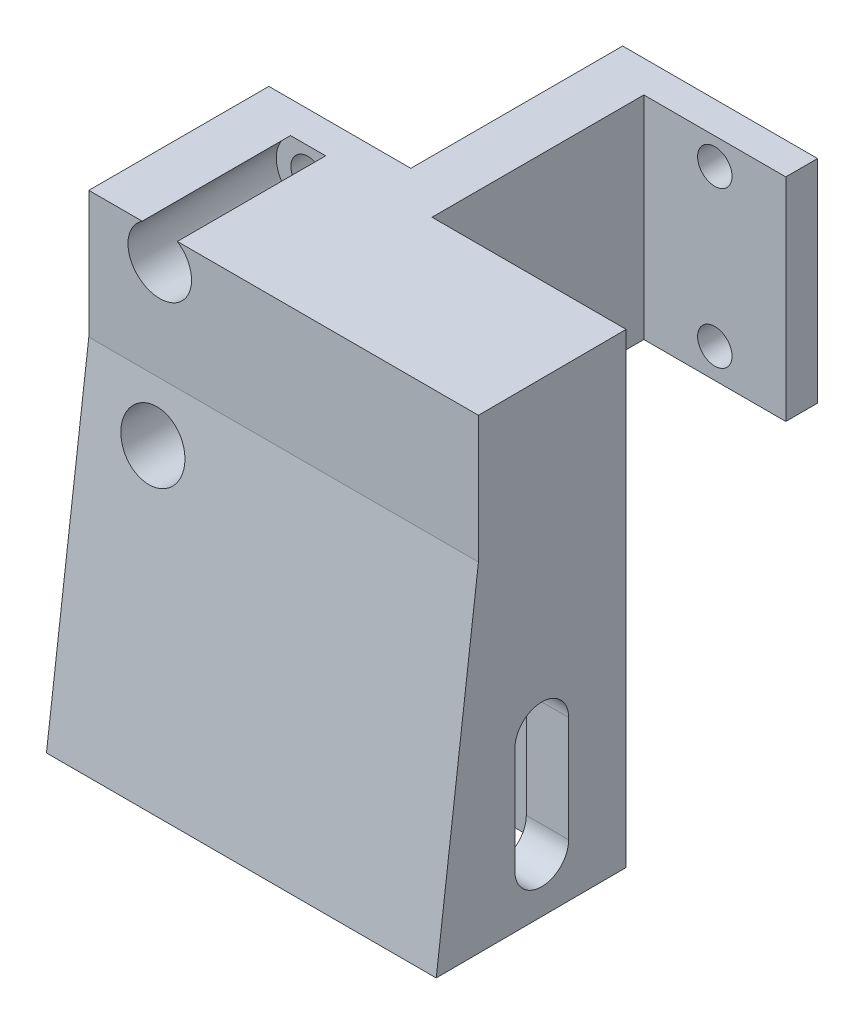
ISO-10303-21;
HEADER;
FILE_DESCRIPTION(('STEP AP214'),'2;1');
FILE_NAME('part.step','',(''),(''),'','','');
FILE_SCHEMA(('AUTOMOTIVE_DESIGN { 1 0 10303 214 1 1 1 1 }'));
ENDSEC;
DATA;
#1=APPLICATION_CONTEXT('core data for automotive mechanical design processes');
#2=APPLICATION_PROTOCOL_DEFINITION('international standard','automotive_design',2000,#1);
#3=PRODUCT_CONTEXT('',#1,'mechanical');
#4=PRODUCT('Part','Part','',(#3));
#5=PRODUCT_RELATED_PRODUCT_CATEGORY('part','',(#4));
#6=PRODUCT_DEFINITION_FORMATION('','',#4);
#7=PRODUCT_DEFINITION_CONTEXT('part definition',#1,'design');
#8=PRODUCT_DEFINITION('design','',#6,#7);
#9=PRODUCT_DEFINITION_SHAPE('','',#8);
#10=(LENGTH_UNIT() NAMED_UNIT(*) SI_UNIT(.MILLI.,.METRE.));
#11=(NAMED_UNIT(*) PLANE_ANGLE_UNIT() SI_UNIT($,.RADIAN.));
#12=(NAMED_UNIT(*) SI_UNIT($,.STERADIAN.) SOLID_ANGLE_UNIT());
#13=UNCERTAINTY_MEASURE_WITH_UNIT(LENGTH_MEASURE(1.E-05),#10,'distance_accuracy_value','');
#14=(GEOMETRIC_REPRESENTATION_CONTEXT(3) GLOBAL_UNCERTAINTY_ASSIGNED_CONTEXT((#13)) GLOBAL_UNIT_ASSIGNED_CONTEXT((#10,
#11,#12)) REPRESENTATION_CONTEXT('',''));
#15=CARTESIAN_POINT('',(0.,0.,0.));
#16=DIRECTION('',(0.,0.,1.));
#17=DIRECTION('',(1.,0.,0.));
#18=AXIS2_PLACEMENT_3D('',#15,#16,#17);
#19=CARTESIAN_POINT('',(89.3394572960189,-9.,8.));
#20=DIRECTION('',(-1.,0.,0.));
#21=DIRECTION('',(0.,0.,1.));
#22=AXIS2_PLACEMENT_3D('',#19,#20,#21);
#23=CYLINDRICAL_SURFACE('',#22,2.55);
#24=CARTESIAN_POINT('',(32.7615730806046,-9.,8.));
#25=DIRECTION('',(-0.999992628267498,0.,0.00383971491924245));
#26=DIRECTION('',(-0.00383971491924245,0.,-0.999992628267498));
#27=AXIS2_PLACEMENT_3D('',#24,#25,#26);
#28=ELLIPSE('',#27,2.55001879805645,2.55);
#29=CARTESIAN_POINT('',(32.7517817353814,-9.,5.45));
#30=VERTEX_POINT('',#29);
#31=CARTESIAN_POINT('',(32.7713644258278,-9.,10.55));
#32=VERTEX_POINT('',#31);
#33=EDGE_CURVE('E250',#30,#32,#28,.F.);
#34=ORIENTED_EDGE('',*,*,#33,.F.);
#35=DIRECTION('',(-1.,0.,0.));
#36=VECTOR('',#35,1.);
#37=CARTESIAN_POINT('',(89.3394572960189,-9.,5.45));
#38=LINE('',#37,#36);
#39=CARTESIAN_POINT('',(36.7518112225287,-9.,5.45));
#40=VERTEX_POINT('',#39);
#41=EDGE_CURVE('E319',#40,#30,#38,.T.);
#42=ORIENTED_EDGE('',*,*,#41,.F.);
#43=CARTESIAN_POINT('',(36.761602567752,-9.,8.));
#44=DIRECTION('',(-0.999992628267498,0.,0.00383971491924245));
#45=DIRECTION('',(-0.00383971491924245,0.,-0.999992628267498));
#46=AXIS2_PLACEMENT_3D('',#43,#44,#45);
#47=ELLIPSE('',#46,2.55001879805645,2.55);
#48=CARTESIAN_POINT('',(36.7713939129752,-9.,10.55));
#49=VERTEX_POINT('',#48);
#50=EDGE_CURVE('E282',#40,#49,#47,.F.);
#51=ORIENTED_EDGE('',*,*,#50,.T.);
#52=DIRECTION('',(-1.,0.,0.));
#53=VECTOR('',#52,1.);
#54=CARTESIAN_POINT('',(89.3394572960189,-9.,10.55));
#55=LINE('',#54,#53);
#56=EDGE_CURVE('E306',#49,#32,#55,.T.);
#57=ORIENTED_EDGE('',*,*,#56,.T.);
#58=EDGE_LOOP('',(#34,#42,#51,#57));
#59=FACE_BOUND('',#58,.T.);
#60=ADVANCED_FACE('F45',(#59),#23,.F.);
#61=CARTESIAN_POINT('',(89.3394572960189,-9.,10.55));
#62=DIRECTION('',(0.,0.,1.));
#63=DIRECTION('',(0.,-1.,0.));
#64=AXIS2_PLACEMENT_3D('',#61,#62,#63);
#65=PLANE('',#64);
#66=DIRECTION('',(0.,-1.,0.));
#67=VECTOR('',#66,1.);
#68=CARTESIAN_POINT('',(32.7713644258278,-9.,10.55));
#69=LINE('',#68,#67);
#70=CARTESIAN_POINT('',(32.7713644258278,-19.,10.55));
#71=VERTEX_POINT('',#70);
#72=EDGE_CURVE('E247',#32,#71,#69,.T.);
#73=ORIENTED_EDGE('',*,*,#72,.F.);
#74=ORIENTED_EDGE('',*,*,#56,.F.);
#75=DIRECTION('',(0.,-1.,0.));
#76=VECTOR('',#75,1.);
#77=CARTESIAN_POINT('',(36.7713939129752,-9.,10.55));
#78=LINE('',#77,#76);
#79=CARTESIAN_POINT('',(36.7713939129752,-19.,10.55));
#80=VERTEX_POINT('',#79);
#81=EDGE_CURVE('E278',#49,#80,#78,.T.);
#82=ORIENTED_EDGE('',*,*,#81,.T.);
#83=DIRECTION('',(-1.,0.,0.));
#84=VECTOR('',#83,1.);
#85=CARTESIAN_POINT('',(89.3394572960189,-19.,10.55));
#86=LINE('',#85,#84);
#87=EDGE_CURVE('E311',#80,#71,#86,.T.);
#88=ORIENTED_EDGE('',*,*,#87,.T.);
#89=EDGE_LOOP('',(#73,#74,#82,#88));
#90=FACE_BOUND('',#89,.T.);
#91=ADVANCED_FACE('F492',(#90),#65,.F.);
#92=CARTESIAN_POINT('',(89.3394572960189,-19.,8.));
#93=DIRECTION('',(-1.,0.,0.));
#94=DIRECTION('',(0.,0.,1.));
#95=AXIS2_PLACEMENT_3D('',#92,#93,#94);
#96=CYLINDRICAL_SURFACE('',#95,2.55);
#97=CARTESIAN_POINT('',(32.7615730806046,-19.,8.));
#98=DIRECTION('',(-0.999992628267498,0.,0.00383971491924245));
#99=DIRECTION('',(-0.00383971491924245,0.,-0.999992628267498));
#100=AXIS2_PLACEMENT_3D('',#97,#98,#99);
#101=ELLIPSE('',#100,2.55001879805645,2.55);
#102=CARTESIAN_POINT('',(32.7517817353814,-19.,5.45));
#103=VERTEX_POINT('',#102);
#104=EDGE_CURVE('E61',#71,#103,#101,.F.);
#105=ORIENTED_EDGE('',*,*,#104,.F.);
#106=ORIENTED_EDGE('',*,*,#87,.F.);
#107=CARTESIAN_POINT('',(36.761602567752,-19.,8.));
#108=DIRECTION('',(-0.999992628267498,0.,0.00383971491924245));
#109=DIRECTION('',(-0.00383971491924245,0.,-0.999992628267498));
#110=AXIS2_PLACEMENT_3D('',#107,#108,#109);
#111=ELLIPSE('',#110,2.55001879805645,2.55);
#112=CARTESIAN_POINT('',(36.7518112225287,-19.,5.45));
#113=VERTEX_POINT('',#112);
#114=EDGE_CURVE('E274',#80,#113,#111,.F.);
#115=ORIENTED_EDGE('',*,*,#114,.T.);
#116=DIRECTION('',(-1.,0.,0.));
#117=VECTOR('',#116,1.);
#118=CARTESIAN_POINT('',(89.3394572960189,-19.,5.45));
#119=LINE('',#118,#117);
#120=EDGE_CURVE('E315',#113,#103,#119,.T.);
#121=ORIENTED_EDGE('',*,*,#120,.T.);
#122=EDGE_LOOP('',(#105,#106,#115,#121));
#123=FACE_BOUND('',#122,.T.);
#124=ADVANCED_FACE('F499',(#123),#96,.F.);
#125=CARTESIAN_POINT('',(89.3394572960189,-9.,5.45));
#126=DIRECTION('',(0.,0.,-1.));
#127=DIRECTION('',(0.,1.,0.));
#128=AXIS2_PLACEMENT_3D('',#125,#126,#127);
#129=PLANE('',#128);
#130=DIRECTION('',(0.,1.,0.));
#131=VECTOR('',#130,1.);
#132=CARTESIAN_POINT('',(32.7517817353814,-9.,5.45));
#133=LINE('',#132,#131);
#134=EDGE_CURVE('E241',#103,#30,#133,.T.);
#135=ORIENTED_EDGE('',*,*,#134,.F.);
#136=ORIENTED_EDGE('',*,*,#120,.F.);
#137=DIRECTION('',(0.,1.,0.));
#138=VECTOR('',#137,1.);
#139=CARTESIAN_POINT('',(36.7518112225287,-9.,5.45));
#140=LINE('',#139,#138);
#141=EDGE_CURVE('E270',#113,#40,#140,.T.);
#142=ORIENTED_EDGE('',*,*,#141,.T.);
#143=ORIENTED_EDGE('',*,*,#41,.T.);
#144=EDGE_LOOP('',(#135,#136,#142,#143));
#145=FACE_BOUND('',#144,.T.);
#146=ADVANCED_FACE('F504',(#145),#129,.F.);
#147=CARTESIAN_POINT('',(0.,20.,-3.));
#148=DIRECTION('',(1.,0.,0.));
#149=DIRECTION('',(0.,0.,-1.));
#150=AXIS2_PLACEMENT_3D('',#147,#148,#149);
#151=PLANE('',#150);
#152=CARTESIAN_POINT('',(0.,-9.,8.));
#153=DIRECTION('',(-1.,0.,0.));
#154=DIRECTION('',(0.,0.,1.));
#155=AXIS2_PLACEMENT_3D('',#152,#153,#154);
#156=CIRCLE('',#155,6.);
#157=CARTESIAN_POINT('',(0.,-9.,14.));
#158=VERTEX_POINT('',#157);
#159=CARTESIAN_POINT('',(0.,-9.,2.00000000000001));
#160=VERTEX_POINT('',#159);
#161=EDGE_CURVE('E212',#158,#160,#156,.T.);
#162=ORIENTED_EDGE('',*,*,#161,.F.);
#163=DIRECTION('',(0.,1.,0.));
#164=VECTOR('',#163,1.);
#165=CARTESIAN_POINT('',(0.,-24.,14.));
#166=LINE('',#165,#164);
#167=CARTESIAN_POINT('',(0.,-24.,14.));
#168=VERTEX_POINT('',#167);
#169=EDGE_CURVE('E209',#168,#158,#166,.T.);
#170=ORIENTED_EDGE('',*,*,#169,.F.);
#171=DIRECTION('',(0.,0.,1.));
#172=VECTOR('',#171,1.);
#173=CARTESIAN_POINT('',(0.,-24.,0.));
#174=LINE('',#173,#172);
#175=CARTESIAN_POINT('',(0.,-24.,18.));
#176=VERTEX_POINT('',#175);
#177=EDGE_CURVE('E326',#168,#176,#174,.T.);
#178=ORIENTED_EDGE('',*,*,#177,.T.);
#179=DIRECTION('',(0.,0.992277876713668,-0.124034734589209));
#180=VECTOR('',#179,1.);
#181=CARTESIAN_POINT('',(0.,-24.,18.));
#182=LINE('',#181,#180);
#183=CARTESIAN_POINT('',(0.,8.,14.));
#184=VERTEX_POINT('',#183);
#185=EDGE_CURVE('E329',#176,#184,#182,.T.);
#186=ORIENTED_EDGE('',*,*,#185,.T.);
#187=DIRECTION('',(0.,1.,0.));
#188=VECTOR('',#187,1.);
#189=CARTESIAN_POINT('',(0.,8.,14.));
#190=LINE('',#189,#188);
#191=CARTESIAN_POINT('',(0.,20.,14.));
#192=VERTEX_POINT('',#191);
#193=EDGE_CURVE('E333',#184,#192,#190,.T.);
#194=ORIENTED_EDGE('',*,*,#193,.T.);
#195=DIRECTION('',(0.,0.,1.));
#196=VECTOR('',#195,1.);
#197=CARTESIAN_POINT('',(0.,20.,-3.));
#198=LINE('',#197,#196);
#199=CARTESIAN_POINT('',(0.,20.,-3.));
#200=VERTEX_POINT('',#199);
#201=EDGE_CURVE('E379',#200,#192,#198,.T.);
#202=ORIENTED_EDGE('',*,*,#201,.F.);
#203=DIRECTION('',(0.,-1.,0.));
#204=VECTOR('',#203,1.);
#205=CARTESIAN_POINT('',(0.,20.,-3.));
#206=LINE('',#205,#204);
#207=CARTESIAN_POINT('',(0.,0.,-3.));
#208=VERTEX_POINT('',#207);
#209=EDGE_CURVE('E402',#200,#208,#206,.T.);
#210=ORIENTED_EDGE('',*,*,#209,.T.);
#211=DIRECTION('',(0.,0.,1.));
#212=VECTOR('',#211,1.);
#213=CARTESIAN_POINT('',(0.,0.,-3.));
#214=LINE('',#213,#212);
#215=CARTESIAN_POINT('',(0.,0.,0.));
#216=VERTEX_POINT('',#215);
#217=EDGE_CURVE('E378',#208,#216,#214,.T.);
#218=ORIENTED_EDGE('',*,*,#217,.T.);
#219=DIRECTION('',(0.,-1.,0.));
#220=VECTOR('',#219,1.);
#221=CARTESIAN_POINT('',(0.,20.,0.));
#222=LINE('',#221,#220);
#223=CARTESIAN_POINT('',(0.,-24.,0.));
#224=VERTEX_POINT('',#223);
#225=EDGE_CURVE('E310',#216,#224,#222,.T.);
#226=ORIENTED_EDGE('',*,*,#225,.T.);
#227=CARTESIAN_POINT('',(0.,-24.,2.));
#228=VERTEX_POINT('',#227);
#229=EDGE_CURVE('E224',#224,#228,#174,.T.);
#230=ORIENTED_EDGE('',*,*,#229,.T.);
#231=DIRECTION('',(0.,-1.,0.));
#232=VECTOR('',#231,1.);
#233=CARTESIAN_POINT('',(0.,-9.,2.00000000000001));
#234=LINE('',#233,#232);
#235=EDGE_CURVE('E204',#160,#228,#234,.T.);
#236=ORIENTED_EDGE('',*,*,#235,.F.);
#237=EDGE_LOOP('',(#162,#170,#178,#186,#194,#202,#210,#218,#226,#230,#236));
#238=FACE_BOUND('',#237,.T.);
#239=ADVANCED_FACE('F47',(#238),#151,.F.);
#240=CARTESIAN_POINT('',(18.4,20.,0.));
#241=DIRECTION('',(-1.,0.,0.));
#242=DIRECTION('',(0.,0.,1.));
#243=AXIS2_PLACEMENT_3D('',#240,#241,#242);
#244=PLANE('',#243);
#245=DIRECTION('',(0.,0.,-1.));
#246=VECTOR('',#245,1.);
#247=CARTESIAN_POINT('',(18.4,0.,0.));
#248=LINE('',#247,#246);
#249=CARTESIAN_POINT('',(18.4,0.,0.));
#250=VERTEX_POINT('',#249);
#251=CARTESIAN_POINT('',(18.4,0.,-20.));
#252=VERTEX_POINT('',#251);
#253=EDGE_CURVE('E411',#250,#252,#248,.T.);
#254=ORIENTED_EDGE('',*,*,#253,.T.);
#255=DIRECTION('',(0.,-1.,0.));
#256=VECTOR('',#255,1.);
#257=CARTESIAN_POINT('',(18.4,20.,-20.));
#258=LINE('',#257,#256);
#259=CARTESIAN_POINT('',(18.4,20.,-20.));
#260=VERTEX_POINT('',#259);
#261=EDGE_CURVE('E448',#260,#252,#258,.T.);
#262=ORIENTED_EDGE('',*,*,#261,.F.);
#263=DIRECTION('',(0.,0.,-1.));
#264=VECTOR('',#263,1.);
#265=CARTESIAN_POINT('',(18.4,20.,0.));
#266=LINE('',#265,#264);
#267=CARTESIAN_POINT('',(18.4,20.,0.));
#268=VERTEX_POINT('',#267);
#269=EDGE_CURVE('E383',#268,#260,#266,.T.);
#270=ORIENTED_EDGE('',*,*,#269,.F.);
#271=DIRECTION('',(0.,-1.,0.));
#272=VECTOR('',#271,1.);
#273=CARTESIAN_POINT('',(18.4,20.,0.));
#274=LINE('',#273,#272);
#275=EDGE_CURVE('E452',#268,#250,#274,.T.);
#276=ORIENTED_EDGE('',*,*,#275,.T.);
#277=EDGE_LOOP('',(#254,#262,#270,#276));
#278=FACE_BOUND('',#277,.T.);
#279=ADVANCED_FACE('F562',(#278),#244,.F.);
#280=CARTESIAN_POINT('',(18.4,20.,-20.));
#281=DIRECTION('',(0.,0.,-1.));
#282=DIRECTION('',(-1.,0.,0.));
#283=AXIS2_PLACEMENT_3D('',#280,#281,#282);
#284=PLANE('',#283);
#285=CARTESIAN_POINT('',(25.1,17.5,-20.));
#286=DIRECTION('',(0.,0.,-1.));
#287=DIRECTION('',(-1.,0.,0.));
#288=AXIS2_PLACEMENT_3D('',#285,#286,#287);
#289=CIRCLE('',#288,1.625);
#290=CARTESIAN_POINT('',(23.475,17.5,-20.));
#291=VERTEX_POINT('',#290);
#292=EDGE_CURVE('E374',#291,#291,#289,.T.);
#293=ORIENTED_EDGE('',*,*,#292,.T.);
#294=EDGE_LOOP('',(#293));
#295=FACE_BOUND('',#294,.T.);
#296=CARTESIAN_POINT('',(25.1,2.8,-20.));
#297=DIRECTION('',(0.,0.,-1.));
#298=DIRECTION('',(-1.,0.,0.));
#299=AXIS2_PLACEMENT_3D('',#296,#297,#298);
#300=CIRCLE('',#299,1.625);
#301=CARTESIAN_POINT('',(23.475,2.8,-20.));
#302=VERTEX_POINT('',#301);
#303=EDGE_CURVE('E365',#302,#302,#300,.T.);
#304=ORIENTED_EDGE('',*,*,#303,.T.);
#305=EDGE_LOOP('',(#304));
#306=FACE_BOUND('',#305,.T.);
#307=DIRECTION('',(1.,0.,0.));
#308=VECTOR('',#307,1.);
#309=CARTESIAN_POINT('',(18.4,0.,-20.));
#310=LINE('',#309,#308);
#311=CARTESIAN_POINT('',(31.8,0.,-20.));
#312=VERTEX_POINT('',#311);
#313=EDGE_CURVE('E415',#252,#312,#310,.T.);
#314=ORIENTED_EDGE('',*,*,#313,.T.);
#315=DIRECTION('',(0.,-1.,0.));
#316=VECTOR('',#315,1.);
#317=CARTESIAN_POINT('',(31.8,20.,-20.));
#318=LINE('',#317,#316);
#319=CARTESIAN_POINT('',(31.8,20.,-20.));
#320=VERTEX_POINT('',#319);
#321=EDGE_CURVE('E444',#320,#312,#318,.T.);
#322=ORIENTED_EDGE('',*,*,#321,.F.);
#323=DIRECTION('',(1.,0.,0.));
#324=VECTOR('',#323,1.);
#325=CARTESIAN_POINT('',(18.4,20.,-20.));
#326=LINE('',#325,#324);
#327=EDGE_CURVE('E387',#260,#320,#326,.T.);
#328=ORIENTED_EDGE('',*,*,#327,.F.);
#329=ORIENTED_EDGE('',*,*,#261,.T.);
#330=EDGE_LOOP('',(#314,#322,#328,#329));
#331=FACE_BOUND('',#330,.T.);
#332=ADVANCED_FACE('F559',(#295,#306,#331),#284,.F.);
#333=CARTESIAN_POINT('',(31.8,20.,-20.));
#334=DIRECTION('',(-1.,0.,0.));
#335=DIRECTION('',(0.,0.,1.));
#336=AXIS2_PLACEMENT_3D('',#333,#334,#335);
#337=PLANE('',#336);
#338=DIRECTION('',(0.,0.,-1.));
#339=VECTOR('',#338,1.);
#340=CARTESIAN_POINT('',(31.8,0.,-20.));
#341=LINE('',#340,#339);
#342=CARTESIAN_POINT('',(31.8,0.,-23.));
#343=VERTEX_POINT('',#342);
#344=EDGE_CURVE('E418',#312,#343,#341,.T.);
#345=ORIENTED_EDGE('',*,*,#344,.T.);
#346=DIRECTION('',(0.,-1.,0.));
#347=VECTOR('',#346,1.);
#348=CARTESIAN_POINT('',(31.8,20.,-23.));
#349=LINE('',#348,#347);
#350=CARTESIAN_POINT('',(31.8,20.,-23.));
#351=VERTEX_POINT('',#350);
#352=EDGE_CURVE('E440',#351,#343,#349,.T.);
#353=ORIENTED_EDGE('',*,*,#352,.F.);
#354=DIRECTION('',(0.,0.,-1.));
#355=VECTOR('',#354,1.);
#356=CARTESIAN_POINT('',(31.8,20.,-20.));
#357=LINE('',#356,#355);
#358=EDGE_CURVE('E390',#320,#351,#357,.T.);
#359=ORIENTED_EDGE('',*,*,#358,.F.);
#360=ORIENTED_EDGE('',*,*,#321,.T.);
#361=EDGE_LOOP('',(#345,#353,#359,#360));
#362=FACE_BOUND('',#361,.T.);
#363=ADVANCED_FACE('F555',(#362),#337,.F.);
#364=CARTESIAN_POINT('',(31.8,20.,-23.));
#365=DIRECTION('',(0.,0.,1.));
#366=DIRECTION('',(1.,0.,0.));
#367=AXIS2_PLACEMENT_3D('',#364,#365,#366);
#368=PLANE('',#367);
#369=CARTESIAN_POINT('',(25.1,17.5,-23.));
#370=DIRECTION('',(0.,0.,1.));
#371=DIRECTION('',(1.,0.,0.));
#372=AXIS2_PLACEMENT_3D('',#369,#370,#371);
#373=CIRCLE('',#372,1.625);
#374=CARTESIAN_POINT('',(26.725,17.5,-23.));
#375=VERTEX_POINT('',#374);
#376=EDGE_CURVE('E361',#375,#375,#373,.T.);
#377=ORIENTED_EDGE('',*,*,#376,.T.);
#378=EDGE_LOOP('',(#377));
#379=FACE_BOUND('',#378,.T.);
#380=CARTESIAN_POINT('',(25.1,2.8,-23.));
#381=DIRECTION('',(0.,0.,1.));
#382=DIRECTION('',(1.,0.,0.));
#383=AXIS2_PLACEMENT_3D('',#380,#381,#382);
#384=CIRCLE('',#383,1.625);
#385=CARTESIAN_POINT('',(26.725,2.8,-23.));
#386=VERTEX_POINT('',#385);
#387=EDGE_CURVE('E366',#386,#386,#384,.T.);
#388=ORIENTED_EDGE('',*,*,#387,.T.);
#389=EDGE_LOOP('',(#388));
#390=FACE_BOUND('',#389,.T.);
#391=DIRECTION('',(-1.,0.,0.));
#392=VECTOR('',#391,1.);
#393=CARTESIAN_POINT('',(31.8,0.,-23.));
#394=LINE('',#393,#392);
#395=CARTESIAN_POINT('',(13.4,0.,-23.));
#396=VERTEX_POINT('',#395);
#397=EDGE_CURVE('E421',#343,#396,#394,.T.);
#398=ORIENTED_EDGE('',*,*,#397,.T.);
#399=DIRECTION('',(0.,-1.,0.));
#400=VECTOR('',#399,1.);
#401=CARTESIAN_POINT('',(13.4,20.,-23.));
#402=LINE('',#401,#400);
#403=CARTESIAN_POINT('',(13.4,20.,-23.));
#404=VERTEX_POINT('',#403);
#405=EDGE_CURVE('E436',#404,#396,#402,.T.);
#406=ORIENTED_EDGE('',*,*,#405,.F.);
#407=DIRECTION('',(-1.,0.,0.));
#408=VECTOR('',#407,1.);
#409=CARTESIAN_POINT('',(31.8,20.,-23.));
#410=LINE('',#409,#408);
#411=EDGE_CURVE('E393',#351,#404,#410,.T.);
#412=ORIENTED_EDGE('',*,*,#411,.F.);
#413=ORIENTED_EDGE('',*,*,#352,.T.);
#414=EDGE_LOOP('',(#398,#406,#412,#413));
#415=FACE_BOUND('',#414,.T.);
#416=ADVANCED_FACE('F551',(#379,#390,#415),#368,.F.);
#417=CARTESIAN_POINT('',(13.4,20.,-23.));
#418=DIRECTION('',(1.,0.,0.));
#419=DIRECTION('',(0.,0.,-1.));
#420=AXIS2_PLACEMENT_3D('',#417,#418,#419);
#421=PLANE('',#420);
#422=DIRECTION('',(0.,0.,1.));
#423=VECTOR('',#422,1.);
#424=CARTESIAN_POINT('',(13.4,0.,-23.));
#425=LINE('',#424,#423);
#426=CARTESIAN_POINT('',(13.4,0.,-3.));
#427=VERTEX_POINT('',#426);
#428=EDGE_CURVE('E424',#396,#427,#425,.T.);
#429=ORIENTED_EDGE('',*,*,#428,.T.);
#430=DIRECTION('',(0.,-1.,0.));
#431=VECTOR('',#430,1.);
#432=CARTESIAN_POINT('',(13.4,20.,-3.));
#433=LINE('',#432,#431);
#434=CARTESIAN_POINT('',(13.4,20.,-3.));
#435=VERTEX_POINT('',#434);
#436=EDGE_CURVE('E432',#435,#427,#433,.T.);
#437=ORIENTED_EDGE('',*,*,#436,.F.);
#438=DIRECTION('',(0.,0.,1.));
#439=VECTOR('',#438,1.);
#440=CARTESIAN_POINT('',(13.4,20.,-23.));
#441=LINE('',#440,#439);
#442=EDGE_CURVE('E396',#404,#435,#441,.T.);
#443=ORIENTED_EDGE('',*,*,#442,.F.);
#444=ORIENTED_EDGE('',*,*,#405,.T.);
#445=EDGE_LOOP('',(#429,#437,#443,#444));
#446=FACE_BOUND('',#445,.T.);
#447=ADVANCED_FACE('F547',(#446),#421,.F.);
#448=CARTESIAN_POINT('',(13.4,20.,-3.));
#449=DIRECTION('',(0.,0.,1.));
#450=DIRECTION('',(1.,0.,0.));
#451=AXIS2_PLACEMENT_3D('',#448,#449,#450);
#452=PLANE('',#451);
#453=CARTESIAN_POINT('',(6.69999999999999,17.5,-3.));
#454=DIRECTION('',(0.,0.,1.));
#455=DIRECTION('',(1.,0.,0.));
#456=AXIS2_PLACEMENT_3D('',#453,#454,#455);
#457=CIRCLE('',#456,1.625);
#458=CARTESIAN_POINT('',(8.32499999999999,17.5,-3.));
#459=VERTEX_POINT('',#458);
#460=EDGE_CURVE('E370',#459,#459,#457,.F.);
#461=ORIENTED_EDGE('',*,*,#460,.F.);
#462=EDGE_LOOP('',(#461));
#463=FACE_BOUND('',#462,.T.);
#464=CARTESIAN_POINT('',(6.69999999999999,2.8,-3.));
#465=DIRECTION('',(0.,0.,1.));
#466=DIRECTION('',(1.,0.,0.));
#467=AXIS2_PLACEMENT_3D('',#464,#465,#466);
#468=CIRCLE('',#467,1.625);
#469=CARTESIAN_POINT('',(8.32499999999999,2.8,-3.));
#470=VERTEX_POINT('',#469);
#471=EDGE_CURVE('E341',#470,#470,#468,.F.);
#472=ORIENTED_EDGE('',*,*,#471,.F.);
#473=EDGE_LOOP('',(#472));
#474=FACE_BOUND('',#473,.T.);
#475=DIRECTION('',(-1.,0.,0.));
#476=VECTOR('',#475,1.);
#477=CARTESIAN_POINT('',(13.4,0.,-3.));
#478=LINE('',#477,#476);
#479=EDGE_CURVE('E384',#427,#208,#478,.T.);
#480=ORIENTED_EDGE('',*,*,#479,.T.);
#481=ORIENTED_EDGE('',*,*,#209,.F.);
#482=DIRECTION('',(-1.,0.,0.));
#483=VECTOR('',#482,1.);
#484=CARTESIAN_POINT('',(13.4,20.,-3.));
#485=LINE('',#484,#483);
#486=EDGE_CURVE('E399',#435,#200,#485,.T.);
#487=ORIENTED_EDGE('',*,*,#486,.F.);
#488=ORIENTED_EDGE('',*,*,#436,.T.);
#489=EDGE_LOOP('',(#480,#481,#487,#488));
#490=FACE_BOUND('',#489,.T.);
#491=ADVANCED_FACE('F541',(#463,#474,#490),#452,.F.);
#492=CARTESIAN_POINT('',(0.,20.,0.));
#493=DIRECTION('',(0.,1.,0.));
#494=DIRECTION('',(0.,0.,1.));
#495=AXIS2_PLACEMENT_3D('',#492,#493,#494);
#496=PLANE('',#495);
#497=DIRECTION('',(-0.00383971491924245,0.,-0.999992628267498));
#498=VECTOR('',#497,1.);
#499=CARTESIAN_POINT('',(36.8,20.,18.));
#500=LINE('',#499,#498);
#501=CARTESIAN_POINT('',(36.7846410271008,20.,14.));
#502=VERTEX_POINT('',#501);
#503=CARTESIAN_POINT('',(36.7308846219536,20.,0.));
#504=VERTEX_POINT('',#503);
#505=EDGE_CURVE('E254',#502,#504,#500,.T.);
#506=ORIENTED_EDGE('',*,*,#505,.T.);
#507=DIRECTION('',(-1.,0.,0.));
#508=VECTOR('',#507,1.);
#509=CARTESIAN_POINT('',(89.3394572960189,20.,0.));
#510=LINE('',#509,#508);
#511=EDGE_CURVE('E337',#504,#268,#510,.T.);
#512=ORIENTED_EDGE('',*,*,#511,.T.);
#513=ORIENTED_EDGE('',*,*,#269,.T.);
#514=ORIENTED_EDGE('',*,*,#327,.T.);
#515=ORIENTED_EDGE('',*,*,#358,.T.);
#516=ORIENTED_EDGE('',*,*,#411,.T.);
#517=ORIENTED_EDGE('',*,*,#442,.T.);
#518=ORIENTED_EDGE('',*,*,#486,.T.);
#519=ORIENTED_EDGE('',*,*,#201,.T.);
#520=DIRECTION('',(-1.,0.,0.));
#521=VECTOR('',#520,1.);
#522=CARTESIAN_POINT('',(89.3394572960189,20.,14.));
#523=LINE('',#522,#521);
#524=CARTESIAN_POINT('',(5.04168760482228,20.,14.));
#525=VERTEX_POINT('',#524);
#526=EDGE_CURVE('E342',#525,#192,#523,.T.);
#527=ORIENTED_EDGE('',*,*,#526,.F.);
#528=DIRECTION('',(0.,0.,-1.));
#529=VECTOR('',#528,1.);
#530=CARTESIAN_POINT('',(5.04168760482228,20.,18.));
#531=LINE('',#530,#529);
#532=CARTESIAN_POINT('',(5.04168760482229,20.,0.));
#533=VERTEX_POINT('',#532);
#534=EDGE_CURVE('E299',#533,#525,#531,.F.);
#535=ORIENTED_EDGE('',*,*,#534,.F.);
#536=DIRECTION('',(-1.,0.,0.));
#537=VECTOR('',#536,1.);
#538=CARTESIAN_POINT('',(0.,20.,0.));
#539=LINE('',#538,#537);
#540=CARTESIAN_POINT('',(8.35831239517769,20.,0.));
#541=VERTEX_POINT('',#540);
#542=EDGE_CURVE('E13',#541,#533,#539,.T.);
#543=ORIENTED_EDGE('',*,*,#542,.F.);
#544=DIRECTION('',(0.,0.,-1.));
#545=VECTOR('',#544,1.);
#546=CARTESIAN_POINT('',(8.3583123951777,20.,18.));
#547=LINE('',#546,#545);
#548=CARTESIAN_POINT('',(8.3583123951777,20.,14.));
#549=VERTEX_POINT('',#548);
#550=EDGE_CURVE('E302',#549,#541,#547,.T.);
#551=ORIENTED_EDGE('',*,*,#550,.F.);
#552=EDGE_CURVE('E338',#502,#549,#523,.T.);
#553=ORIENTED_EDGE('',*,*,#552,.F.);
#554=EDGE_LOOP('',(#506,#512,#513,#514,#515,#516,#517,#518,#519,#527,#535,#543,#551,#553));
#555=FACE_BOUND('',#554,.T.);
#556=ADVANCED_FACE('F474',(#555),#496,.T.);
#557=CARTESIAN_POINT('',(0.,0.,0.));
#558=DIRECTION('',(0.,1.,0.));
#559=DIRECTION('',(0.,0.,1.));
#560=AXIS2_PLACEMENT_3D('',#557,#558,#559);
#561=PLANE('',#560);
#562=ORIENTED_EDGE('',*,*,#217,.F.);
#563=ORIENTED_EDGE('',*,*,#479,.F.);
#564=ORIENTED_EDGE('',*,*,#428,.F.);
#565=ORIENTED_EDGE('',*,*,#397,.F.);
#566=ORIENTED_EDGE('',*,*,#344,.F.);
#567=ORIENTED_EDGE('',*,*,#313,.F.);
#568=ORIENTED_EDGE('',*,*,#253,.F.);
#569=DIRECTION('',(1.,0.,0.));
#570=VECTOR('',#569,1.);
#571=CARTESIAN_POINT('',(0.,0.,0.));
#572=LINE('',#571,#570);
#573=CARTESIAN_POINT('',(7.77703296142688,0.,0.));
#574=VERTEX_POINT('',#573);
#575=EDGE_CURVE('E406',#574,#250,#572,.T.);
#576=ORIENTED_EDGE('',*,*,#575,.F.);
#577=CARTESIAN_POINT('',(5.62296703857309,0.,0.));
#578=VERTEX_POINT('',#577);
#579=EDGE_CURVE('E412',#578,#574,#572,.T.);
#580=ORIENTED_EDGE('',*,*,#579,.F.);
#581=EDGE_CURVE('E407',#216,#578,#572,.T.);
#582=ORIENTED_EDGE('',*,*,#581,.F.);
#583=EDGE_LOOP('',(#562,#563,#564,#565,#566,#567,#568,#576,#580,#582));
#584=FACE_BOUND('',#583,.T.);
#585=ADVANCED_FACE('F537',(#584),#561,.F.);
#586=CARTESIAN_POINT('',(25.1,2.8,-23.));
#587=DIRECTION('',(0.,0.,1.));
#588=DIRECTION('',(1.,0.,0.));
#589=AXIS2_PLACEMENT_3D('',#586,#587,#588);
#590=CYLINDRICAL_SURFACE('',#589,1.625);
#591=ORIENTED_EDGE('',*,*,#387,.F.);
#592=EDGE_LOOP('',(#591));
#593=FACE_BOUND('',#592,.T.);
#594=ORIENTED_EDGE('',*,*,#303,.F.);
#595=EDGE_LOOP('',(#594));
#596=FACE_BOUND('',#595,.T.);
#597=ADVANCED_FACE('F533',(#593,#596),#590,.F.);
#598=CARTESIAN_POINT('',(25.1,17.5,-23.));
#599=DIRECTION('',(0.,0.,1.));
#600=DIRECTION('',(1.,0.,0.));
#601=AXIS2_PLACEMENT_3D('',#598,#599,#600);
#602=CYLINDRICAL_SURFACE('',#601,1.625);
#603=ORIENTED_EDGE('',*,*,#376,.F.);
#604=EDGE_LOOP('',(#603));
#605=FACE_BOUND('',#604,.T.);
#606=ORIENTED_EDGE('',*,*,#292,.F.);
#607=EDGE_LOOP('',(#606));
#608=FACE_BOUND('',#607,.T.);
#609=ADVANCED_FACE('F529',(#605,#608),#602,.F.);
#610=CARTESIAN_POINT('',(6.69999999999999,2.8,-23.));
#611=DIRECTION('',(0.,0.,1.));
#612=DIRECTION('',(1.,0.,0.));
#613=AXIS2_PLACEMENT_3D('',#610,#611,#612);
#614=CYLINDRICAL_SURFACE('',#613,1.625);
#615=CARTESIAN_POINT('',(6.69999999999999,2.8,0.));
#616=DIRECTION('',(0.,0.,-1.));
#617=DIRECTION('',(-1.,0.,0.));
#618=AXIS2_PLACEMENT_3D('',#615,#616,#617);
#619=CIRCLE('',#618,1.625);
#620=CARTESIAN_POINT('',(5.07499999999999,2.8,0.));
#621=VERTEX_POINT('',#620);
#622=EDGE_CURVE('E305',#621,#621,#619,.T.);
#623=ORIENTED_EDGE('',*,*,#622,.F.);
#624=EDGE_LOOP('',(#623));
#625=FACE_BOUND('',#624,.T.);
#626=ORIENTED_EDGE('',*,*,#471,.T.);
#627=EDGE_LOOP('',(#626));
#628=FACE_BOUND('',#627,.T.);
#629=ADVANCED_FACE('F525',(#625,#628),#614,.F.);
#630=CARTESIAN_POINT('',(6.69999999999999,17.5,-23.));
#631=DIRECTION('',(0.,0.,1.));
#632=DIRECTION('',(1.,0.,0.));
#633=AXIS2_PLACEMENT_3D('',#630,#631,#632);
#634=CYLINDRICAL_SURFACE('',#633,1.625);
#635=CARTESIAN_POINT('',(6.69999999999999,17.5,0.));
#636=DIRECTION('',(0.,0.,-1.));
#637=DIRECTION('',(-1.,0.,0.));
#638=AXIS2_PLACEMENT_3D('',#635,#636,#637);
#639=CIRCLE('',#638,1.625);
#640=CARTESIAN_POINT('',(5.07499999999999,17.5,0.));
#641=VERTEX_POINT('',#640);
#642=EDGE_CURVE('E323',#641,#641,#639,.T.);
#643=ORIENTED_EDGE('',*,*,#642,.F.);
#644=EDGE_LOOP('',(#643));
#645=FACE_BOUND('',#644,.T.);
#646=ORIENTED_EDGE('',*,*,#460,.T.);
#647=EDGE_LOOP('',(#646));
#648=FACE_BOUND('',#647,.T.);
#649=ADVANCED_FACE('F510',(#645,#648),#634,.F.);
#650=CARTESIAN_POINT('',(89.3394572960189,8.,14.));
#651=DIRECTION('',(0.,0.,1.));
#652=DIRECTION('',(1.,0.,0.));
#653=AXIS2_PLACEMENT_3D('',#650,#651,#652);
#654=PLANE('',#653);
#655=DIRECTION('',(0.,-1.,0.));
#656=VECTOR('',#655,1.);
#657=CARTESIAN_POINT('',(36.7846410271008,8.,14.));
#658=LINE('',#657,#656);
#659=CARTESIAN_POINT('',(36.7846410271008,8.,14.));
#660=VERTEX_POINT('',#659);
#661=EDGE_CURVE('E267',#502,#660,#658,.T.);
#662=ORIENTED_EDGE('',*,*,#661,.F.);
#663=ORIENTED_EDGE('',*,*,#552,.T.);
#664=CARTESIAN_POINT('',(6.69999999999999,17.5,14.));
#665=DIRECTION('',(0.,0.,1.));
#666=DIRECTION('',(1.,0.,0.));
#667=AXIS2_PLACEMENT_3D('',#664,#665,#666);
#668=CIRCLE('',#667,3.);
#669=EDGE_CURVE('E54',#525,#549,#668,.T.);
#670=ORIENTED_EDGE('',*,*,#669,.F.);
#671=ORIENTED_EDGE('',*,*,#526,.T.);
#672=ORIENTED_EDGE('',*,*,#193,.F.);
#673=DIRECTION('',(-1.,0.,0.));
#674=VECTOR('',#673,1.);
#675=CARTESIAN_POINT('',(89.3394572960189,8.,14.));
#676=LINE('',#675,#674);
#677=EDGE_CURVE('E343',#660,#184,#676,.T.);
#678=ORIENTED_EDGE('',*,*,#677,.F.);
#679=EDGE_LOOP('',(#662,#663,#670,#671,#672,#678));
#680=FACE_BOUND('',#679,.T.);
#681=ADVANCED_FACE('F506',(#680),#654,.T.);
#682=CARTESIAN_POINT('',(89.3394572960189,-24.,18.));
#683=DIRECTION('',(0.,0.124034734589209,0.992277876713668));
#684=DIRECTION('',(0.,-0.992277876713668,0.124034734589209));
#685=AXIS2_PLACEMENT_3D('',#682,#683,#684);
#686=PLANE('',#685);
#687=DIRECTION('',(0.000476261477765063,-0.992277764176949,0.124034720522119));
#688=VECTOR('',#687,1.);
#689=CARTESIAN_POINT('',(36.8000119172622,-24.0248292897757,18.003103661222));
#690=LINE('',#689,#688);
#691=CARTESIAN_POINT('',(36.8,-24.,18.));
#692=VERTEX_POINT('',#691);
#693=EDGE_CURVE('E264',#660,#692,#690,.T.);
#694=ORIENTED_EDGE('',*,*,#693,.F.);
#695=ORIENTED_EDGE('',*,*,#677,.T.);
#696=ORIENTED_EDGE('',*,*,#185,.F.);
#697=DIRECTION('',(-1.,0.,0.));
#698=VECTOR('',#697,1.);
#699=CARTESIAN_POINT('',(89.3394572960189,-24.,18.));
#700=LINE('',#699,#698);
#701=EDGE_CURVE('E346',#692,#176,#700,.T.);
#702=ORIENTED_EDGE('',*,*,#701,.F.);
#703=EDGE_LOOP('',(#694,#695,#696,#702));
#704=FACE_BOUND('',#703,.T.);
#705=CARTESIAN_POINT('',(6.69999999999999,2.8,14.65));
#706=DIRECTION('',(0.,0.124034734589209,0.992277876713668));
#707=DIRECTION('',(0.,0.992277876713668,-0.124034734589209));
#708=AXIS2_PLACEMENT_3D('',#705,#706,#707);
#709=ELLIPSE('',#708,3.02334665561196,3.);
#710=CARTESIAN_POINT('',(6.69999999999999,5.8,14.275));
#711=VERTEX_POINT('',#710);
#712=EDGE_CURVE('E291',#711,#711,#709,.T.);
#713=ORIENTED_EDGE('',*,*,#712,.F.);
#714=EDGE_LOOP('',(#713));
#715=FACE_BOUND('',#714,.T.);
#716=ADVANCED_FACE('F509',(#704,#715),#686,.T.);
#717=CARTESIAN_POINT('',(89.3394572960189,-24.,0.));
#718=DIRECTION('',(0.,-1.,0.));
#719=DIRECTION('',(0.,0.,-1.));
#720=AXIS2_PLACEMENT_3D('',#717,#718,#719);
#721=PLANE('',#720);
#722=DIRECTION('',(-1.,0.,0.));
#723=VECTOR('',#722,1.);
#724=CARTESIAN_POINT('',(60.9484354753687,-24.,14.));
#725=LINE('',#724,#723);
#726=CARTESIAN_POINT('',(32.7846115399534,-24.,14.));
#727=VERTEX_POINT('',#726);
#728=EDGE_CURVE('E234',#727,#168,#725,.T.);
#729=ORIENTED_EDGE('',*,*,#728,.F.);
#730=DIRECTION('',(-0.00383971491924245,0.,-0.999992628267498));
#731=VECTOR('',#730,1.);
#732=CARTESIAN_POINT('',(32.7389505314088,-24.,2.10831717868873));
#733=LINE('',#732,#731);
#734=CARTESIAN_POINT('',(32.7385346212558,-24.,2.));
#735=VERTEX_POINT('',#734);
#736=EDGE_CURVE('E233',#727,#735,#733,.T.);
#737=ORIENTED_EDGE('',*,*,#736,.T.);
#738=DIRECTION('',(-1.,0.,0.));
#739=VECTOR('',#738,1.);
#740=CARTESIAN_POINT('',(60.9484354753687,-24.,2.));
#741=LINE('',#740,#739);
#742=EDGE_CURVE('E208',#735,#228,#741,.T.);
#743=ORIENTED_EDGE('',*,*,#742,.T.);
#744=ORIENTED_EDGE('',*,*,#229,.F.);
#745=DIRECTION('',(-1.,0.,0.));
#746=VECTOR('',#745,1.);
#747=CARTESIAN_POINT('',(89.3394572960189,-24.,0.));
#748=LINE('',#747,#746);
#749=CARTESIAN_POINT('',(36.7308846219536,-24.,0.));
#750=VERTEX_POINT('',#749);
#751=EDGE_CURVE('E350',#750,#224,#748,.T.);
#752=ORIENTED_EDGE('',*,*,#751,.F.);
#753=DIRECTION('',(-0.00383971491924245,0.,-0.999992628267498));
#754=VECTOR('',#753,1.);
#755=CARTESIAN_POINT('',(36.8,-24.,18.));
#756=LINE('',#755,#754);
#757=EDGE_CURVE('E253',#692,#750,#756,.T.);
#758=ORIENTED_EDGE('',*,*,#757,.F.);
#759=ORIENTED_EDGE('',*,*,#701,.T.);
#760=ORIENTED_EDGE('',*,*,#177,.F.);
#761=EDGE_LOOP('',(#729,#737,#743,#744,#752,#758,#759,#760));
#762=FACE_BOUND('',#761,.T.);
#763=ADVANCED_FACE('F513',(#762),#721,.T.);
#764=CARTESIAN_POINT('',(89.3394572960189,20.,0.));
#765=DIRECTION('',(0.,0.,-1.));
#766=DIRECTION('',(0.,1.,0.));
#767=AXIS2_PLACEMENT_3D('',#764,#765,#766);
#768=PLANE('',#767);
#769=DIRECTION('',(0.,-1.,0.));
#770=VECTOR('',#769,1.);
#771=CARTESIAN_POINT('',(36.7308846219536,20.,0.));
#772=LINE('',#771,#770);
#773=EDGE_CURVE('E258',#504,#750,#772,.T.);
#774=ORIENTED_EDGE('',*,*,#773,.T.);
#775=ORIENTED_EDGE('',*,*,#751,.T.);
#776=ORIENTED_EDGE('',*,*,#225,.F.);
#777=ORIENTED_EDGE('',*,*,#581,.T.);
#778=CARTESIAN_POINT('',(6.69999999999999,2.8,0.));
#779=DIRECTION('',(0.,0.,-1.));
#780=DIRECTION('',(0.,1.,0.));
#781=AXIS2_PLACEMENT_3D('',#778,#779,#780);
#782=CIRCLE('',#781,3.);
#783=EDGE_CURVE('E287',#574,#578,#782,.T.);
#784=ORIENTED_EDGE('',*,*,#783,.F.);
#785=ORIENTED_EDGE('',*,*,#575,.T.);
#786=ORIENTED_EDGE('',*,*,#275,.F.);
#787=ORIENTED_EDGE('',*,*,#511,.F.);
#788=EDGE_LOOP('',(#774,#775,#776,#777,#784,#785,#786,#787));
#789=FACE_BOUND('',#788,.T.);
#790=ADVANCED_FACE('F517',(#789),#768,.T.);
#791=CARTESIAN_POINT('',(6.69999999999999,2.8,0.));
#792=DIRECTION('',(0.,0.,-1.));
#793=DIRECTION('',(0.,1.,0.));
#794=AXIS2_PLACEMENT_3D('',#791,#792,#793);
#795=PLANE('',#794);
#796=ORIENTED_EDGE('',*,*,#622,.T.);
#797=EDGE_LOOP('',(#796));
#798=FACE_BOUND('',#797,.T.);
#799=EDGE_CURVE('E292',#578,#574,#782,.T.);
#800=ORIENTED_EDGE('',*,*,#799,.F.);
#801=ORIENTED_EDGE('',*,*,#579,.T.);
#802=EDGE_LOOP('',(#800,#801));
#803=FACE_BOUND('',#802,.T.);
#804=ADVANCED_FACE('F521',(#798,#803),#795,.F.);
#805=CARTESIAN_POINT('',(6.69999999999999,2.8,18.));
#806=DIRECTION('',(0.,0.,-1.));
#807=DIRECTION('',(0.,1.,0.));
#808=AXIS2_PLACEMENT_3D('',#805,#806,#807);
#809=CYLINDRICAL_SURFACE('',#808,3.);
#810=ORIENTED_EDGE('',*,*,#712,.T.);
#811=EDGE_LOOP('',(#810));
#812=FACE_BOUND('',#811,.T.);
#813=ORIENTED_EDGE('',*,*,#783,.T.);
#814=ORIENTED_EDGE('',*,*,#799,.T.);
#815=EDGE_LOOP('',(#813,#814));
#816=FACE_BOUND('',#815,.T.);
#817=ADVANCED_FACE('F488',(#812,#816),#809,.F.);
#818=CARTESIAN_POINT('',(6.69999999999999,17.5,18.));
#819=DIRECTION('',(0.,0.,-1.));
#820=DIRECTION('',(0.,1.,0.));
#821=AXIS2_PLACEMENT_3D('',#818,#819,#820);
#822=CYLINDRICAL_SURFACE('',#821,3.);
#823=ORIENTED_EDGE('',*,*,#550,.T.);
#824=CARTESIAN_POINT('',(6.69999999999999,17.5,0.));
#825=DIRECTION('',(0.,0.,-1.));
#826=DIRECTION('',(0.,1.,0.));
#827=AXIS2_PLACEMENT_3D('',#824,#825,#826);
#828=CIRCLE('',#827,3.);
#829=EDGE_CURVE('E286',#541,#533,#828,.T.);
#830=ORIENTED_EDGE('',*,*,#829,.T.);
#831=ORIENTED_EDGE('',*,*,#534,.T.);
#832=ORIENTED_EDGE('',*,*,#669,.T.);
#833=EDGE_LOOP('',(#823,#830,#831,#832));
#834=FACE_BOUND('',#833,.T.);
#835=ADVANCED_FACE('F466',(#834),#822,.F.);
#836=CARTESIAN_POINT('',(6.69999999999999,17.5,0.));
#837=DIRECTION('',(0.,0.,-1.));
#838=DIRECTION('',(0.,1.,0.));
#839=AXIS2_PLACEMENT_3D('',#836,#837,#838);
#840=PLANE('',#839);
#841=ORIENTED_EDGE('',*,*,#642,.T.);
#842=EDGE_LOOP('',(#841));
#843=FACE_BOUND('',#842,.T.);
#844=ORIENTED_EDGE('',*,*,#542,.T.);
#845=ORIENTED_EDGE('',*,*,#829,.F.);
#846=EDGE_LOOP('',(#844,#845));
#847=FACE_BOUND('',#846,.T.);
#848=ADVANCED_FACE('F476',(#843,#847),#840,.F.);
#849=CARTESIAN_POINT('',(36.8,20.,18.));
#850=DIRECTION('',(-0.999992628267498,0.,0.00383971491924245));
#851=DIRECTION('',(0.00383971491924245,0.,0.999992628267498));
#852=AXIS2_PLACEMENT_3D('',#849,#850,#851);
#853=PLANE('',#852);
#854=ORIENTED_EDGE('',*,*,#661,.T.);
#855=ORIENTED_EDGE('',*,*,#693,.T.);
#856=ORIENTED_EDGE('',*,*,#757,.T.);
#857=ORIENTED_EDGE('',*,*,#773,.F.);
#858=ORIENTED_EDGE('',*,*,#505,.F.);
#859=EDGE_LOOP('',(#854,#855,#856,#857,#858));
#860=FACE_BOUND('',#859,.T.);
#861=ORIENTED_EDGE('',*,*,#141,.F.);
#862=ORIENTED_EDGE('',*,*,#114,.F.);
#863=ORIENTED_EDGE('',*,*,#81,.F.);
#864=ORIENTED_EDGE('',*,*,#50,.F.);
#865=EDGE_LOOP('',(#861,#862,#863,#864));
#866=FACE_BOUND('',#865,.T.);
#867=ADVANCED_FACE('F478',(#860,#866),#853,.F.);
#868=CARTESIAN_POINT('',(32.80002948693,20.,18.015358859677));
#869=DIRECTION('',(-0.999992628267498,0.,0.00383971491924245));
#870=DIRECTION('',(0.00383971491924245,0.,0.999992628267498));
#871=AXIS2_PLACEMENT_3D('',#868,#869,#870);
#872=PLANE('',#871);
#873=CARTESIAN_POINT('',(32.7615730806046,-9.,8.));
#874=DIRECTION('',(-0.999992628267498,0.,0.00383971491924245));
#875=DIRECTION('',(-0.00383971491924245,0.,-0.999992628267498));
#876=AXIS2_PLACEMENT_3D('',#873,#874,#875);
#877=ELLIPSE('',#876,6.00004423072107,6.);
#878=CARTESIAN_POINT('',(32.7385346212558,-9.,2.));
#879=VERTEX_POINT('',#878);
#880=CARTESIAN_POINT('',(32.7846115399534,-9.,14.));
#881=VERTEX_POINT('',#880);
#882=EDGE_CURVE('E242',#879,#881,#877,.F.);
#883=ORIENTED_EDGE('',*,*,#882,.F.);
#884=DIRECTION('',(0.,1.,0.));
#885=VECTOR('',#884,1.);
#886=CARTESIAN_POINT('',(32.7385346212558,-9.,2.));
#887=LINE('',#886,#885);
#888=EDGE_CURVE('E69',#735,#879,#887,.T.);
#889=ORIENTED_EDGE('',*,*,#888,.F.);
#890=ORIENTED_EDGE('',*,*,#736,.F.);
#891=DIRECTION('',(0.,-1.,0.));
#892=VECTOR('',#891,1.);
#893=CARTESIAN_POINT('',(32.7846115399534,-24.,14.));
#894=LINE('',#893,#892);
#895=EDGE_CURVE('E605',#881,#727,#894,.T.);
#896=ORIENTED_EDGE('',*,*,#895,.F.);
#897=EDGE_LOOP('',(#883,#889,#890,#896));
#898=FACE_BOUND('',#897,.T.);
#899=ORIENTED_EDGE('',*,*,#33,.T.);
#900=ORIENTED_EDGE('',*,*,#72,.T.);
#901=ORIENTED_EDGE('',*,*,#104,.T.);
#902=ORIENTED_EDGE('',*,*,#134,.T.);
#903=EDGE_LOOP('',(#899,#900,#901,#902));
#904=FACE_BOUND('',#903,.T.);
#905=ADVANCED_FACE('F485',(#898,#904),#872,.T.);
#906=CARTESIAN_POINT('',(60.9484354753687,-9.,8.));
#907=DIRECTION('',(-1.,0.,0.));
#908=DIRECTION('',(0.,0.,1.));
#909=AXIS2_PLACEMENT_3D('',#906,#907,#908);
#910=CYLINDRICAL_SURFACE('',#909,6.);
#911=ORIENTED_EDGE('',*,*,#882,.T.);
#912=DIRECTION('',(-1.,0.,0.));
#913=VECTOR('',#912,1.);
#914=CARTESIAN_POINT('',(60.9484354753687,-9.,14.));
#915=LINE('',#914,#913);
#916=EDGE_CURVE('E215',#881,#158,#915,.T.);
#917=ORIENTED_EDGE('',*,*,#916,.T.);
#918=ORIENTED_EDGE('',*,*,#161,.T.);
#919=DIRECTION('',(-1.,0.,0.));
#920=VECTOR('',#919,1.);
#921=CARTESIAN_POINT('',(60.9484354753687,-9.,2.));
#922=LINE('',#921,#920);
#923=EDGE_CURVE('E200',#879,#160,#922,.T.);
#924=ORIENTED_EDGE('',*,*,#923,.F.);
#925=EDGE_LOOP('',(#911,#917,#918,#924));
#926=FACE_BOUND('',#925,.T.);
#927=ADVANCED_FACE('F213',(#926),#910,.F.);
#928=CARTESIAN_POINT('',(60.9484354753687,-24.,14.));
#929=DIRECTION('',(0.,0.,1.));
#930=DIRECTION('',(0.,-1.,0.));
#931=AXIS2_PLACEMENT_3D('',#928,#929,#930);
#932=PLANE('',#931);
#933=ORIENTED_EDGE('',*,*,#895,.T.);
#934=ORIENTED_EDGE('',*,*,#728,.T.);
#935=ORIENTED_EDGE('',*,*,#169,.T.);
#936=ORIENTED_EDGE('',*,*,#916,.F.);
#937=EDGE_LOOP('',(#933,#934,#935,#936));
#938=FACE_BOUND('',#937,.T.);
#939=ADVANCED_FACE('F611',(#938),#932,.F.);
#940=CARTESIAN_POINT('',(60.9484354753687,-9.,2.));
#941=DIRECTION('',(0.,0.,-1.));
#942=DIRECTION('',(0.,1.,0.));
#943=AXIS2_PLACEMENT_3D('',#940,#941,#942);
#944=PLANE('',#943);
#945=ORIENTED_EDGE('',*,*,#888,.T.);
#946=ORIENTED_EDGE('',*,*,#923,.T.);
#947=ORIENTED_EDGE('',*,*,#235,.T.);
#948=ORIENTED_EDGE('',*,*,#742,.F.);
#949=EDGE_LOOP('',(#945,#946,#947,#948));
#950=FACE_BOUND('',#949,.T.);
#951=ADVANCED_FACE('F202',(#950),#944,.F.);
#952=CLOSED_SHELL('',(#60,#91,#124,#146,#239,#279,#332,#363,#416,#447,#491,#556,#585,#597,#609,
#629,#649,#681,#716,#763,#790,#804,#817,#835,#848,#867,#905,#927,#939,#951));
#953=MANIFOLD_SOLID_BREP('B2',#952);
#954=ADVANCED_BREP_SHAPE_REPRESENTATION('',(#18,#953),#14);
#955=SHAPE_DEFINITION_REPRESENTATION(#9,#954);
ENDSEC;
END-ISO-10303-21;
